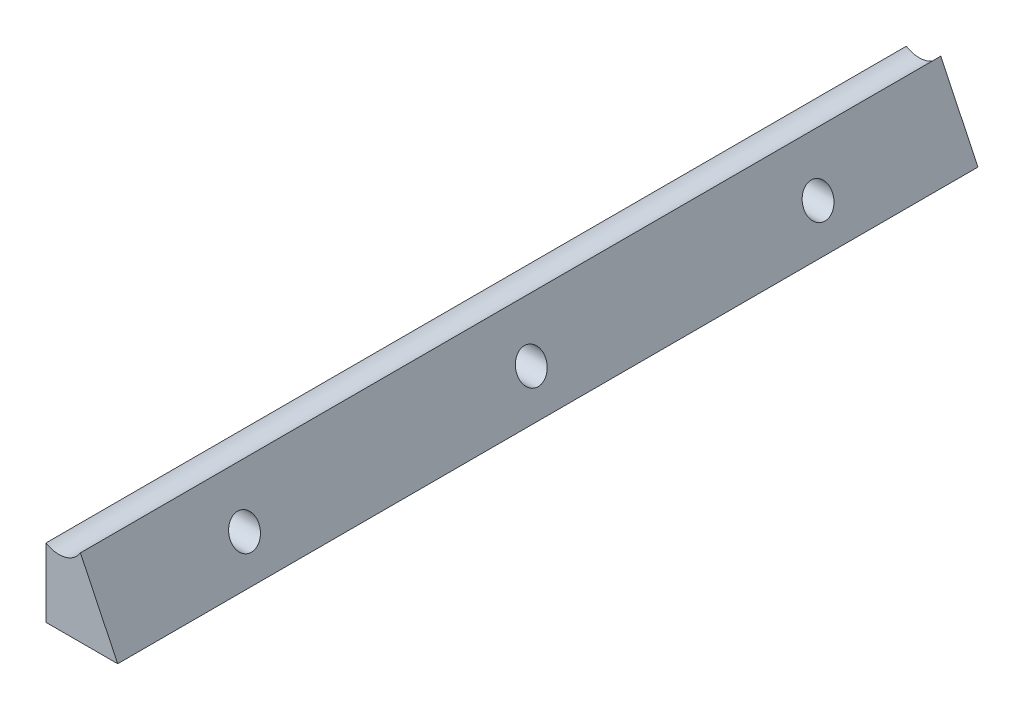
ISO-10303-21;
HEADER;
FILE_DESCRIPTION(('STEP AP214'),'2;1');
FILE_NAME('part.step','',(''),(''),'','','');
FILE_SCHEMA(('AUTOMOTIVE_DESIGN { 1 0 10303 214 1 1 1 1 }'));
ENDSEC;
DATA;
#1=APPLICATION_CONTEXT('core data for automotive mechanical design processes');
#2=APPLICATION_PROTOCOL_DEFINITION('international standard','automotive_design',2000,#1);
#3=PRODUCT_CONTEXT('',#1,'mechanical');
#4=PRODUCT('Part','Part','',(#3));
#5=PRODUCT_RELATED_PRODUCT_CATEGORY('part','',(#4));
#6=PRODUCT_DEFINITION_FORMATION('','',#4);
#7=PRODUCT_DEFINITION_CONTEXT('part definition',#1,'design');
#8=PRODUCT_DEFINITION('design','',#6,#7);
#9=PRODUCT_DEFINITION_SHAPE('','',#8);
#10=(LENGTH_UNIT() NAMED_UNIT(*) SI_UNIT(.MILLI.,.METRE.));
#11=(NAMED_UNIT(*) PLANE_ANGLE_UNIT() SI_UNIT($,.RADIAN.));
#12=(NAMED_UNIT(*) SI_UNIT($,.STERADIAN.) SOLID_ANGLE_UNIT());
#13=UNCERTAINTY_MEASURE_WITH_UNIT(LENGTH_MEASURE(1.E-05),#10,'distance_accuracy_value','');
#14=(GEOMETRIC_REPRESENTATION_CONTEXT(3) GLOBAL_UNCERTAINTY_ASSIGNED_CONTEXT((#13)) GLOBAL_UNIT_ASSIGNED_CONTEXT((#10,
#11,#12)) REPRESENTATION_CONTEXT('',''));
#15=CARTESIAN_POINT('',(0.,0.,0.));
#16=DIRECTION('',(0.,0.,1.));
#17=DIRECTION('',(1.,0.,0.));
#18=AXIS2_PLACEMENT_3D('',#15,#16,#17);
#19=CARTESIAN_POINT('',(0.,0.,150.));
#20=DIRECTION('',(1.,0.,0.));
#21=DIRECTION('',(0.,0.,-1.));
#22=AXIS2_PLACEMENT_3D('',#19,#20,#21);
#23=PLANE('',#22);
#24=CARTESIAN_POINT('',(0.,6.,25.));
#25=DIRECTION('',(-1.,0.,0.));
#26=DIRECTION('',(0.,0.,1.));
#27=AXIS2_PLACEMENT_3D('',#24,#25,#26);
#28=CIRCLE('',#27,2.5);
#29=CARTESIAN_POINT('',(0.,6.,27.5));
#30=VERTEX_POINT('',#29);
#31=EDGE_CURVE('E149',#30,#30,#28,.T.);
#32=ORIENTED_EDGE('',*,*,#31,.F.);
#33=EDGE_LOOP('',(#32));
#34=FACE_BOUND('',#33,.T.);
#35=CARTESIAN_POINT('',(0.,6.,75.));
#36=DIRECTION('',(-1.,0.,0.));
#37=DIRECTION('',(0.,0.,1.));
#38=AXIS2_PLACEMENT_3D('',#35,#36,#37);
#39=CIRCLE('',#38,2.5);
#40=CARTESIAN_POINT('',(0.,6.,77.5));
#41=VERTEX_POINT('',#40);
#42=EDGE_CURVE('E141',#41,#41,#39,.T.);
#43=ORIENTED_EDGE('',*,*,#42,.F.);
#44=EDGE_LOOP('',(#43));
#45=FACE_BOUND('',#44,.T.);
#46=CARTESIAN_POINT('',(0.,6.,125.));
#47=DIRECTION('',(-1.,0.,0.));
#48=DIRECTION('',(0.,0.,1.));
#49=AXIS2_PLACEMENT_3D('',#46,#47,#48);
#50=CIRCLE('',#49,2.5);
#51=CARTESIAN_POINT('',(0.,6.,127.5));
#52=VERTEX_POINT('',#51);
#53=EDGE_CURVE('E137',#52,#52,#50,.T.);
#54=ORIENTED_EDGE('',*,*,#53,.F.);
#55=EDGE_LOOP('',(#54));
#56=FACE_BOUND('',#55,.T.);
#57=DIRECTION('',(0.,-1.,0.));
#58=VECTOR('',#57,1.);
#59=CARTESIAN_POINT('',(0.,0.,0.));
#60=LINE('',#59,#58);
#61=CARTESIAN_POINT('',(0.,12.,0.));
#62=VERTEX_POINT('',#61);
#63=CARTESIAN_POINT('',(0.,0.,0.));
#64=VERTEX_POINT('',#63);
#65=EDGE_CURVE('E113',#62,#64,#60,.T.);
#66=ORIENTED_EDGE('',*,*,#65,.T.);
#67=DIRECTION('',(0.,0.,-1.));
#68=VECTOR('',#67,1.);
#69=CARTESIAN_POINT('',(0.,0.,150.));
#70=LINE('',#69,#68);
#71=CARTESIAN_POINT('',(0.,0.,150.));
#72=VERTEX_POINT('',#71);
#73=EDGE_CURVE('E11',#72,#64,#70,.T.);
#74=ORIENTED_EDGE('',*,*,#73,.F.);
#75=DIRECTION('',(0.,-1.,0.));
#76=VECTOR('',#75,1.);
#77=CARTESIAN_POINT('',(0.,0.,150.));
#78=LINE('',#77,#76);
#79=CARTESIAN_POINT('',(0.,12.,150.));
#80=VERTEX_POINT('',#79);
#81=EDGE_CURVE('E96',#80,#72,#78,.T.);
#82=ORIENTED_EDGE('',*,*,#81,.F.);
#83=DIRECTION('',(0.,0.,-1.));
#84=VECTOR('',#83,1.);
#85=CARTESIAN_POINT('',(0.,12.,150.));
#86=LINE('',#85,#84);
#87=EDGE_CURVE('E109',#80,#62,#86,.T.);
#88=ORIENTED_EDGE('',*,*,#87,.T.);
#89=EDGE_LOOP('',(#66,#74,#82,#88));
#90=FACE_BOUND('',#89,.T.);
#91=ADVANCED_FACE('F43',(#34,#45,#56,#90),#23,.F.);
#92=CARTESIAN_POINT('',(0.,0.,150.));
#93=DIRECTION('',(0.,1.,0.));
#94=DIRECTION('',(0.,0.,1.));
#95=AXIS2_PLACEMENT_3D('',#92,#93,#94);
#96=PLANE('',#95);
#97=DIRECTION('',(1.,0.,0.));
#98=VECTOR('',#97,1.);
#99=CARTESIAN_POINT('',(0.,0.,0.));
#100=LINE('',#99,#98);
#101=CARTESIAN_POINT('',(12.5,0.,0.));
#102=VERTEX_POINT('',#101);
#103=EDGE_CURVE('E101',#64,#102,#100,.T.);
#104=ORIENTED_EDGE('',*,*,#103,.T.);
#105=DIRECTION('',(0.,0.,-1.));
#106=VECTOR('',#105,1.);
#107=CARTESIAN_POINT('',(12.5,0.,150.));
#108=LINE('',#107,#106);
#109=CARTESIAN_POINT('',(12.5,0.,150.));
#110=VERTEX_POINT('',#109);
#111=EDGE_CURVE('E53',#110,#102,#108,.T.);
#112=ORIENTED_EDGE('',*,*,#111,.F.);
#113=DIRECTION('',(1.,0.,0.));
#114=VECTOR('',#113,1.);
#115=CARTESIAN_POINT('',(0.,0.,150.));
#116=LINE('',#115,#114);
#117=EDGE_CURVE('E91',#72,#110,#116,.T.);
#118=ORIENTED_EDGE('',*,*,#117,.F.);
#119=ORIENTED_EDGE('',*,*,#73,.T.);
#120=EDGE_LOOP('',(#104,#112,#118,#119));
#121=FACE_BOUND('',#120,.T.);
#122=ADVANCED_FACE('F100',(#121),#96,.F.);
#123=CARTESIAN_POINT('',(6.,13.5,150.));
#124=DIRECTION('',(-0.9010016697591,-0.4338156187729,0.));
#125=DIRECTION('',(0.4338156187729,-0.9010016697591,0.));
#126=AXIS2_PLACEMENT_3D('',#123,#124,#125);
#127=PLANE('',#126);
#128=CARTESIAN_POINT('',(9.61111111111111,6.,25.));
#129=DIRECTION('',(-0.9010016697591,-0.4338156187729,0.));
#130=DIRECTION('',(-0.4338156187729,0.9010016697591,0.));
#131=AXIS2_PLACEMENT_3D('',#128,#129,#130);
#132=ELLIPSE('',#131,2.7746896414392,2.5);
#133=CARTESIAN_POINT('',(8.40740740740741,8.5,25.));
#134=VERTEX_POINT('',#133);
#135=EDGE_CURVE('E145',#134,#134,#132,.T.);
#136=ORIENTED_EDGE('',*,*,#135,.T.);
#137=EDGE_LOOP('',(#136));
#138=FACE_BOUND('',#137,.T.);
#139=CARTESIAN_POINT('',(9.61111111111111,6.,75.));
#140=DIRECTION('',(-0.9010016697591,-0.4338156187729,0.));
#141=DIRECTION('',(-0.4338156187729,0.9010016697591,0.));
#142=AXIS2_PLACEMENT_3D('',#139,#140,#141);
#143=ELLIPSE('',#142,2.7746896414392,2.5);
#144=CARTESIAN_POINT('',(8.40740740740741,8.5,75.));
#145=VERTEX_POINT('',#144);
#146=EDGE_CURVE('E46',#145,#145,#143,.T.);
#147=ORIENTED_EDGE('',*,*,#146,.T.);
#148=EDGE_LOOP('',(#147));
#149=FACE_BOUND('',#148,.T.);
#150=CARTESIAN_POINT('',(9.61111111111111,6.,125.));
#151=DIRECTION('',(-0.9010016697591,-0.4338156187729,0.));
#152=DIRECTION('',(-0.4338156187729,0.9010016697591,0.));
#153=AXIS2_PLACEMENT_3D('',#150,#151,#152);
#154=ELLIPSE('',#153,2.7746896414392,2.5);
#155=CARTESIAN_POINT('',(8.40740740740741,8.5,125.));
#156=VERTEX_POINT('',#155);
#157=EDGE_CURVE('E117',#156,#156,#154,.T.);
#158=ORIENTED_EDGE('',*,*,#157,.T.);
#159=EDGE_LOOP('',(#158));
#160=FACE_BOUND('',#159,.T.);
#161=DIRECTION('',(-0.4338156187729,0.9010016697591,0.));
#162=VECTOR('',#161,1.);
#163=CARTESIAN_POINT('',(6.,13.5,0.));
#164=LINE('',#163,#162);
#165=CARTESIAN_POINT('',(6.,13.5,0.));
#166=VERTEX_POINT('',#165);
#167=EDGE_CURVE('E78',#102,#166,#164,.T.);
#168=ORIENTED_EDGE('',*,*,#167,.T.);
#169=DIRECTION('',(0.,0.,-1.));
#170=VECTOR('',#169,1.);
#171=CARTESIAN_POINT('',(6.,13.5,150.));
#172=LINE('',#171,#170);
#173=CARTESIAN_POINT('',(6.,13.5,150.));
#174=VERTEX_POINT('',#173);
#175=EDGE_CURVE('E103',#174,#166,#172,.T.);
#176=ORIENTED_EDGE('',*,*,#175,.F.);
#177=DIRECTION('',(-0.4338156187729,0.9010016697591,0.));
#178=VECTOR('',#177,1.);
#179=CARTESIAN_POINT('',(6.,13.5,150.));
#180=LINE('',#179,#178);
#181=EDGE_CURVE('E94',#110,#174,#180,.T.);
#182=ORIENTED_EDGE('',*,*,#181,.F.);
#183=ORIENTED_EDGE('',*,*,#111,.T.);
#184=EDGE_LOOP('',(#168,#176,#182,#183));
#185=FACE_BOUND('',#184,.T.);
#186=ADVANCED_FACE('F105',(#138,#149,#160,#185),#127,.F.);
#187=CARTESIAN_POINT('',(2.25,15.75,150.));
#188=DIRECTION('',(0.,0.,-1.));
#189=DIRECTION('',(-1.,0.,0.));
#190=AXIS2_PLACEMENT_3D('',#187,#188,#189);
#191=CYLINDRICAL_SURFACE('',#190,4.37321392113398);
#192=CARTESIAN_POINT('',(2.25,15.75,0.));
#193=DIRECTION('',(0.,0.,-1.));
#194=DIRECTION('',(1.,0.,0.));
#195=AXIS2_PLACEMENT_3D('',#192,#193,#194);
#196=CIRCLE('',#195,4.37321392113398);
#197=EDGE_CURVE('E84',#166,#62,#196,.T.);
#198=ORIENTED_EDGE('',*,*,#197,.T.);
#199=ORIENTED_EDGE('',*,*,#87,.F.);
#200=CARTESIAN_POINT('',(2.25,15.75,150.));
#201=DIRECTION('',(0.,0.,-1.));
#202=DIRECTION('',(1.,0.,0.));
#203=AXIS2_PLACEMENT_3D('',#200,#201,#202);
#204=CIRCLE('',#203,4.37321392113398);
#205=EDGE_CURVE('E61',#174,#80,#204,.T.);
#206=ORIENTED_EDGE('',*,*,#205,.F.);
#207=ORIENTED_EDGE('',*,*,#175,.T.);
#208=EDGE_LOOP('',(#198,#199,#206,#207));
#209=FACE_BOUND('',#208,.T.);
#210=ADVANCED_FACE('F127',(#209),#191,.F.);
#211=CARTESIAN_POINT('',(2.25,15.75,150.));
#212=DIRECTION('',(0.,0.,1.));
#213=DIRECTION('',(1.,0.,0.));
#214=AXIS2_PLACEMENT_3D('',#211,#212,#213);
#215=PLANE('',#214);
#216=ORIENTED_EDGE('',*,*,#81,.T.);
#217=ORIENTED_EDGE('',*,*,#117,.T.);
#218=ORIENTED_EDGE('',*,*,#181,.T.);
#219=ORIENTED_EDGE('',*,*,#205,.T.);
#220=EDGE_LOOP('',(#216,#217,#218,#219));
#221=FACE_BOUND('',#220,.T.);
#222=ADVANCED_FACE('F92',(#221),#215,.T.);
#223=CARTESIAN_POINT('',(2.25,15.75,0.));
#224=DIRECTION('',(0.,0.,1.));
#225=DIRECTION('',(1.,0.,0.));
#226=AXIS2_PLACEMENT_3D('',#223,#224,#225);
#227=PLANE('',#226);
#228=ORIENTED_EDGE('',*,*,#65,.F.);
#229=ORIENTED_EDGE('',*,*,#197,.F.);
#230=ORIENTED_EDGE('',*,*,#167,.F.);
#231=ORIENTED_EDGE('',*,*,#103,.F.);
#232=EDGE_LOOP('',(#228,#229,#230,#231));
#233=FACE_BOUND('',#232,.T.);
#234=ADVANCED_FACE('F130',(#233),#227,.F.);
#235=CARTESIAN_POINT('',(0.,6.,125.));
#236=DIRECTION('',(-1.,0.,0.));
#237=DIRECTION('',(0.,0.,1.));
#238=AXIS2_PLACEMENT_3D('',#235,#236,#237);
#239=CYLINDRICAL_SURFACE('',#238,2.5);
#240=ORIENTED_EDGE('',*,*,#53,.T.);
#241=EDGE_LOOP('',(#240));
#242=FACE_BOUND('',#241,.T.);
#243=ORIENTED_EDGE('',*,*,#157,.F.);
#244=EDGE_LOOP('',(#243));
#245=FACE_BOUND('',#244,.T.);
#246=ADVANCED_FACE('F163',(#242,#245),#239,.F.);
#247=CARTESIAN_POINT('',(0.,6.,75.));
#248=DIRECTION('',(-1.,0.,0.));
#249=DIRECTION('',(0.,0.,1.));
#250=AXIS2_PLACEMENT_3D('',#247,#248,#249);
#251=CYLINDRICAL_SURFACE('',#250,2.5);
#252=ORIENTED_EDGE('',*,*,#42,.T.);
#253=EDGE_LOOP('',(#252));
#254=FACE_BOUND('',#253,.T.);
#255=ORIENTED_EDGE('',*,*,#146,.F.);
#256=EDGE_LOOP('',(#255));
#257=FACE_BOUND('',#256,.T.);
#258=ADVANCED_FACE('F166',(#254,#257),#251,.F.);
#259=CARTESIAN_POINT('',(0.,6.,25.));
#260=DIRECTION('',(-1.,0.,0.));
#261=DIRECTION('',(0.,0.,1.));
#262=AXIS2_PLACEMENT_3D('',#259,#260,#261);
#263=CYLINDRICAL_SURFACE('',#262,2.5);
#264=ORIENTED_EDGE('',*,*,#31,.T.);
#265=EDGE_LOOP('',(#264));
#266=FACE_BOUND('',#265,.T.);
#267=ORIENTED_EDGE('',*,*,#135,.F.);
#268=EDGE_LOOP('',(#267));
#269=FACE_BOUND('',#268,.T.);
#270=ADVANCED_FACE('F154',(#266,#269),#263,.F.);
#271=CLOSED_SHELL('',(#91,#122,#186,#210,#222,#234,#246,#258,#270));
#272=MANIFOLD_SOLID_BREP('B2',#271);
#273=ADVANCED_BREP_SHAPE_REPRESENTATION('',(#18,#272),#14);
#274=SHAPE_DEFINITION_REPRESENTATION(#9,#273);
ENDSEC;
END-ISO-10303-21;
